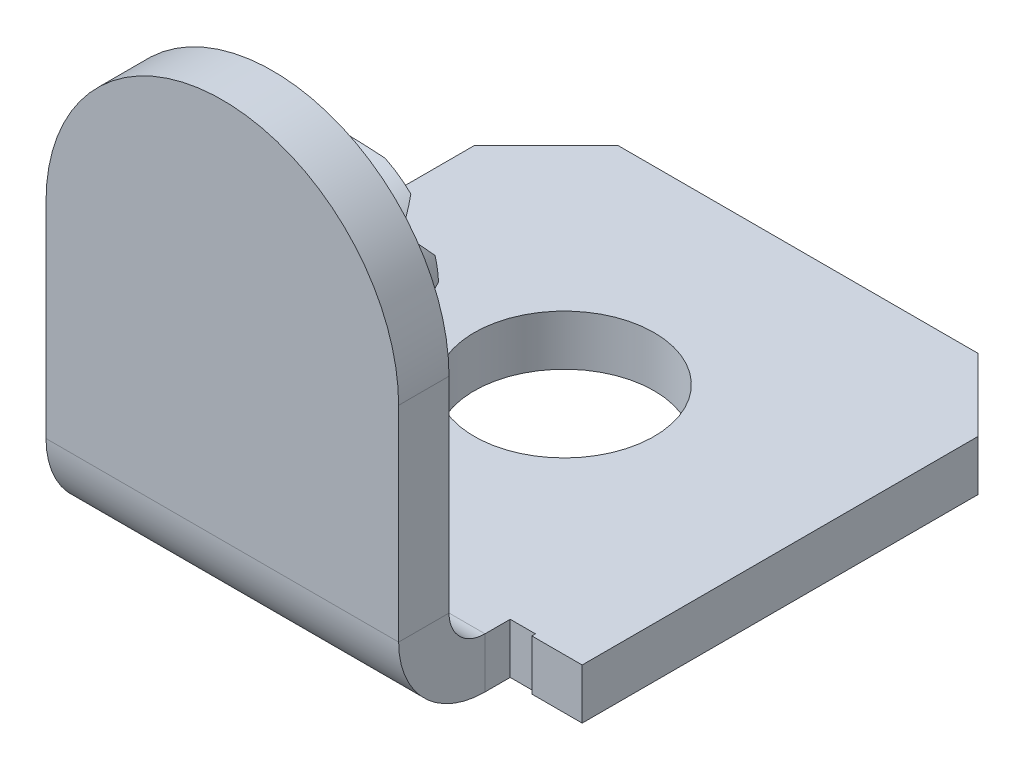
ISO-10303-21;
HEADER;
FILE_DESCRIPTION(('STEP AP214'),'2;1');
FILE_NAME('part.step','',(''),(''),'','','');
FILE_SCHEMA(('AUTOMOTIVE_DESIGN { 1 0 10303 214 1 1 1 1 }'));
ENDSEC;
DATA;
#1=APPLICATION_CONTEXT('core data for automotive mechanical design processes');
#2=APPLICATION_PROTOCOL_DEFINITION('international standard','automotive_design',2000,#1);
#3=PRODUCT_CONTEXT('',#1,'mechanical');
#4=PRODUCT('Part','Part','',(#3));
#5=PRODUCT_RELATED_PRODUCT_CATEGORY('part','',(#4));
#6=PRODUCT_DEFINITION_FORMATION('','',#4);
#7=PRODUCT_DEFINITION_CONTEXT('part definition',#1,'design');
#8=PRODUCT_DEFINITION('design','',#6,#7);
#9=PRODUCT_DEFINITION_SHAPE('','',#8);
#10=(LENGTH_UNIT() NAMED_UNIT(*) SI_UNIT(.MILLI.,.METRE.));
#11=(NAMED_UNIT(*) PLANE_ANGLE_UNIT() SI_UNIT($,.RADIAN.));
#12=(NAMED_UNIT(*) SI_UNIT($,.STERADIAN.) SOLID_ANGLE_UNIT());
#13=UNCERTAINTY_MEASURE_WITH_UNIT(LENGTH_MEASURE(1.E-05),#10,'distance_accuracy_value','');
#14=(GEOMETRIC_REPRESENTATION_CONTEXT(3) GLOBAL_UNCERTAINTY_ASSIGNED_CONTEXT((#13)) GLOBAL_UNIT_ASSIGNED_CONTEXT((#10,
#11,#12)) REPRESENTATION_CONTEXT('',''));
#15=CARTESIAN_POINT('',(0.,0.,0.));
#16=DIRECTION('',(0.,0.,1.));
#17=DIRECTION('',(1.,0.,0.));
#18=AXIS2_PLACEMENT_3D('',#15,#16,#17);
#19=CARTESIAN_POINT('',(0.,3.35,3.05));
#20=DIRECTION('',(0.,0.,-1.));
#21=DIRECTION('',(-1.,0.,0.));
#22=AXIS2_PLACEMENT_3D('',#19,#20,#21);
#23=PLANE('',#22);
#24=DIRECTION('',(1.,0.,0.));
#25=VECTOR('',#24,1.);
#26=CARTESIAN_POINT('',(0.,2.1647478800214,3.05));
#27=LINE('',#26,#25);
#28=CARTESIAN_POINT('',(-0.547822986546511,2.1647478800214,3.05));
#29=VERTEX_POINT('',#28);
#30=CARTESIAN_POINT('',(0.547822986546511,2.1647478800214,3.05));
#31=VERTEX_POINT('',#30);
#32=EDGE_CURVE('E446',#29,#31,#27,.T.);
#33=ORIENTED_EDGE('',*,*,#32,.F.);
#34=CARTESIAN_POINT('',(0.,3.35,3.05));
#35=DIRECTION('',(0.,0.,-1.));
#36=DIRECTION('',(-1.,0.,0.));
#37=AXIS2_PLACEMENT_3D('',#34,#35,#36);
#38=CIRCLE('',#37,1.30573068145866);
#39=CARTESIAN_POINT('',(-0.795916672141053,2.31489166580961,3.05));
#40=VERTEX_POINT('',#39);
#41=EDGE_CURVE('E599',#29,#40,#38,.T.);
#42=ORIENTED_EDGE('',*,*,#41,.T.);
#43=DIRECTION('',(-1.,0.,0.));
#44=VECTOR('',#43,1.);
#45=CARTESIAN_POINT('',(0.,2.31489166580961,3.05));
#46=LINE('',#45,#44);
#47=CARTESIAN_POINT('',(0.795916672141053,2.31489166580961,3.05));
#48=VERTEX_POINT('',#47);
#49=EDGE_CURVE('E444',#48,#40,#46,.T.);
#50=ORIENTED_EDGE('',*,*,#49,.F.);
#51=EDGE_CURVE('E592',#48,#31,#38,.T.);
#52=ORIENTED_EDGE('',*,*,#51,.T.);
#53=EDGE_LOOP('',(#33,#42,#50,#52));
#54=FACE_BOUND('',#53,.T.);
#55=ADVANCED_FACE('F77',(#54),#23,.T.);
#56=DIRECTION('',(1.,0.,0.));
#57=VECTOR('',#56,1.);
#58=CARTESIAN_POINT('',(0.,2.61454519184912,3.05));
#59=LINE('',#58,#57);
#60=CARTESIAN_POINT('',(-1.07890631552061,2.61454519184912,3.05));
#61=VERTEX_POINT('',#60);
#62=CARTESIAN_POINT('',(1.07890631552061,2.61454519184912,3.05));
#63=VERTEX_POINT('',#62);
#64=EDGE_CURVE('E442',#61,#63,#59,.T.);
#65=ORIENTED_EDGE('',*,*,#64,.F.);
#66=CARTESIAN_POINT('',(-1.18747366065813,2.80700928392313,3.05));
#67=VERTEX_POINT('',#66);
#68=EDGE_CURVE('E299',#61,#67,#38,.T.);
#69=ORIENTED_EDGE('',*,*,#68,.T.);
#70=DIRECTION('',(-1.,0.,0.));
#71=VECTOR('',#70,1.);
#72=CARTESIAN_POINT('',(0.,2.80700928392313,3.05));
#73=LINE('',#72,#71);
#74=CARTESIAN_POINT('',(1.18747366065813,2.80700928392313,3.05));
#75=VERTEX_POINT('',#74);
#76=EDGE_CURVE('E440',#75,#67,#73,.T.);
#77=ORIENTED_EDGE('',*,*,#76,.F.);
#78=EDGE_CURVE('E600',#75,#63,#38,.T.);
#79=ORIENTED_EDGE('',*,*,#78,.T.);
#80=EDGE_LOOP('',(#65,#69,#77,#79));
#81=FACE_BOUND('',#80,.T.);
#82=ADVANCED_FACE('F524',(#81),#23,.T.);
#83=DIRECTION('',(1.,0.,0.));
#84=VECTOR('',#83,1.);
#85=CARTESIAN_POINT('',(0.,3.41081231897144,3.05));
#86=LINE('',#85,#84);
#87=CARTESIAN_POINT('',(-1.30431379443898,3.41081231897144,3.05));
#88=VERTEX_POINT('',#87);
#89=CARTESIAN_POINT('',(1.30431379443898,3.41081231897144,3.05));
#90=VERTEX_POINT('',#89);
#91=EDGE_CURVE('E438',#88,#90,#86,.T.);
#92=ORIENTED_EDGE('',*,*,#91,.F.);
#93=CARTESIAN_POINT('',(-1.25625795015122,3.70601766133768,3.05));
#94=VERTEX_POINT('',#93);
#95=EDGE_CURVE('E295',#88,#94,#38,.T.);
#96=ORIENTED_EDGE('',*,*,#95,.T.);
#97=DIRECTION('',(-1.,0.,0.));
#98=VECTOR('',#97,1.);
#99=CARTESIAN_POINT('',(0.,3.70601766133768,3.05));
#100=LINE('',#99,#98);
#101=CARTESIAN_POINT('',(1.25625795015122,3.70601766133768,3.05));
#102=VERTEX_POINT('',#101);
#103=EDGE_CURVE('E436',#102,#94,#100,.T.);
#104=ORIENTED_EDGE('',*,*,#103,.F.);
#105=EDGE_CURVE('E300',#102,#90,#38,.T.);
#106=ORIENTED_EDGE('',*,*,#105,.T.);
#107=EDGE_LOOP('',(#92,#96,#104,#106));
#108=FACE_BOUND('',#107,.T.);
#109=ADVANCED_FACE('F530',(#108),#23,.T.);
#110=CARTESIAN_POINT('',(0.,0.,4.75));
#111=DIRECTION('',(0.,0.,-1.));
#112=DIRECTION('',(-1.,0.,0.));
#113=AXIS2_PLACEMENT_3D('',#110,#111,#112);
#114=PLANE('',#113);
#115=DIRECTION('',(0.,1.,0.));
#116=VECTOR('',#115,1.);
#117=CARTESIAN_POINT('',(2.45,0.,4.75));
#118=LINE('',#117,#116);
#119=CARTESIAN_POINT('',(2.45,0.499999999999998,4.75));
#120=VERTEX_POINT('',#119);
#121=CARTESIAN_POINT('',(2.45,3.35,4.75));
#122=VERTEX_POINT('',#121);
#123=EDGE_CURVE('E312',#120,#122,#118,.T.);
#124=ORIENTED_EDGE('',*,*,#123,.T.);
#125=CARTESIAN_POINT('',(0.,3.35,4.75));
#126=DIRECTION('',(0.,0.,-1.));
#127=DIRECTION('',(-1.,0.,0.));
#128=AXIS2_PLACEMENT_3D('',#125,#126,#127);
#129=CIRCLE('',#128,2.45);
#130=CARTESIAN_POINT('',(-2.45,3.35,4.75));
#131=VERTEX_POINT('',#130);
#132=EDGE_CURVE('E309',#131,#122,#129,.T.);
#133=ORIENTED_EDGE('',*,*,#132,.F.);
#134=DIRECTION('',(0.,-1.,0.));
#135=VECTOR('',#134,1.);
#136=CARTESIAN_POINT('',(-2.45,0.,4.75));
#137=LINE('',#136,#135);
#138=CARTESIAN_POINT('',(-2.45,0.499999999999998,4.75));
#139=VERTEX_POINT('',#138);
#140=EDGE_CURVE('E316',#131,#139,#137,.T.);
#141=ORIENTED_EDGE('',*,*,#140,.T.);
#142=DIRECTION('',(1.,0.,0.));
#143=VECTOR('',#142,1.);
#144=CARTESIAN_POINT('',(-2.45,0.499999999999998,4.75));
#145=LINE('',#144,#143);
#146=EDGE_CURVE('E323',#120,#139,#145,.F.);
#147=ORIENTED_EDGE('',*,*,#146,.F.);
#148=EDGE_LOOP('',(#124,#133,#141,#147));
#149=FACE_BOUND('',#148,.T.);
#150=ADVANCED_FACE('F543',(#149),#114,.F.);
#151=CARTESIAN_POINT('',(0.,0.,4.05));
#152=DIRECTION('',(0.,0.,-1.));
#153=DIRECTION('',(-1.,0.,0.));
#154=AXIS2_PLACEMENT_3D('',#151,#152,#153);
#155=PLANE('',#154);
#156=CARTESIAN_POINT('',(0.,3.35,4.05));
#157=DIRECTION('',(0.,0.,-1.));
#158=DIRECTION('',(-1.,0.,0.));
#159=AXIS2_PLACEMENT_3D('',#156,#157,#158);
#160=CIRCLE('',#159,1.);
#161=CARTESIAN_POINT('',(-1.,3.35,4.05));
#162=VERTEX_POINT('',#161);
#163=EDGE_CURVE('E303',#162,#162,#160,.T.);
#164=ORIENTED_EDGE('',*,*,#163,.F.);
#165=EDGE_LOOP('',(#164));
#166=FACE_BOUND('',#165,.T.);
#167=CARTESIAN_POINT('',(0.,3.35,4.05));
#168=DIRECTION('',(0.,0.,-1.));
#169=DIRECTION('',(-1.,0.,0.));
#170=AXIS2_PLACEMENT_3D('',#167,#168,#169);
#171=CIRCLE('',#170,2.45);
#172=CARTESIAN_POINT('',(-2.45,3.35,4.05));
#173=VERTEX_POINT('',#172);
#174=CARTESIAN_POINT('',(2.45,3.35,4.05));
#175=VERTEX_POINT('',#174);
#176=EDGE_CURVE('E298',#173,#175,#171,.T.);
#177=ORIENTED_EDGE('',*,*,#176,.T.);
#178=DIRECTION('',(0.,-1.,0.));
#179=VECTOR('',#178,1.);
#180=CARTESIAN_POINT('',(2.45,5.8,4.05));
#181=LINE('',#180,#179);
#182=CARTESIAN_POINT('',(2.45,0.499999999999998,4.05));
#183=VERTEX_POINT('',#182);
#184=EDGE_CURVE('E318',#183,#175,#181,.F.);
#185=ORIENTED_EDGE('',*,*,#184,.F.);
#186=DIRECTION('',(1.,0.,0.));
#187=VECTOR('',#186,1.);
#188=CARTESIAN_POINT('',(-2.45,0.499999999999998,4.05));
#189=LINE('',#188,#187);
#190=CARTESIAN_POINT('',(-2.45,0.499999999999998,4.05));
#191=VERTEX_POINT('',#190);
#192=EDGE_CURVE('E329',#191,#183,#189,.T.);
#193=ORIENTED_EDGE('',*,*,#192,.F.);
#194=DIRECTION('',(0.,1.,0.));
#195=VECTOR('',#194,1.);
#196=CARTESIAN_POINT('',(-2.45,0.,4.05));
#197=LINE('',#196,#195);
#198=EDGE_CURVE('E321',#173,#191,#197,.F.);
#199=ORIENTED_EDGE('',*,*,#198,.F.);
#200=EDGE_LOOP('',(#177,#185,#193,#199));
#201=FACE_BOUND('',#200,.T.);
#202=ADVANCED_FACE('F548',(#166,#201),#155,.T.);
#203=CARTESIAN_POINT('',(2.45,5.8,4.75));
#204=DIRECTION('',(-1.,0.,0.));
#205=DIRECTION('',(0.,0.,1.));
#206=AXIS2_PLACEMENT_3D('',#203,#204,#205);
#207=PLANE('',#206);
#208=DIRECTION('',(0.,0.,-1.));
#209=VECTOR('',#208,1.);
#210=CARTESIAN_POINT('',(2.45,3.35,14.05));
#211=LINE('',#210,#209);
#212=EDGE_CURVE('E279',#122,#175,#211,.T.);
#213=ORIENTED_EDGE('',*,*,#212,.F.);
#214=ORIENTED_EDGE('',*,*,#123,.F.);
#215=DIRECTION('',(0.,0.,-1.));
#216=VECTOR('',#215,1.);
#217=CARTESIAN_POINT('',(2.45,0.499999999999998,4.05));
#218=LINE('',#217,#216);
#219=EDGE_CURVE('E326',#183,#120,#218,.F.);
#220=ORIENTED_EDGE('',*,*,#219,.F.);
#221=ORIENTED_EDGE('',*,*,#184,.T.);
#222=EDGE_LOOP('',(#213,#214,#220,#221));
#223=FACE_BOUND('',#222,.T.);
#224=ADVANCED_FACE('F857',(#223),#207,.F.);
#225=CARTESIAN_POINT('',(-2.8,0.,3.2));
#226=DIRECTION('',(1.,0.,0.));
#227=DIRECTION('',(0.,0.,-1.));
#228=AXIS2_PLACEMENT_3D('',#225,#226,#227);
#229=PLANE('',#228);
#230=DIRECTION('',(0.,1.,0.));
#231=VECTOR('',#230,1.);
#232=CARTESIAN_POINT('',(-2.8,-0.7,3.25));
#233=LINE('',#232,#231);
#234=CARTESIAN_POINT('',(-2.8,-0.7,3.25));
#235=VERTEX_POINT('',#234);
#236=CARTESIAN_POINT('',(-2.8,0.,3.25));
#237=VERTEX_POINT('',#236);
#238=EDGE_CURVE('E378',#235,#237,#233,.T.);
#239=ORIENTED_EDGE('',*,*,#238,.F.);
#240=DIRECTION('',(0.,0.,1.));
#241=VECTOR('',#240,1.);
#242=CARTESIAN_POINT('',(-2.8,-0.7,0.));
#243=LINE('',#242,#241);
#244=CARTESIAN_POINT('',(-2.8,-0.7,3.2));
#245=VERTEX_POINT('',#244);
#246=EDGE_CURVE('E359',#245,#235,#243,.T.);
#247=ORIENTED_EDGE('',*,*,#246,.F.);
#248=DIRECTION('',(0.,-1.,0.));
#249=VECTOR('',#248,1.);
#250=CARTESIAN_POINT('',(-2.8,0.,3.2));
#251=LINE('',#250,#249);
#252=CARTESIAN_POINT('',(-2.8,0.,3.2));
#253=VERTEX_POINT('',#252);
#254=EDGE_CURVE('E353',#253,#245,#251,.T.);
#255=ORIENTED_EDGE('',*,*,#254,.F.);
#256=DIRECTION('',(0.,0.,1.));
#257=VECTOR('',#256,1.);
#258=CARTESIAN_POINT('',(-2.8,0.,3.2));
#259=LINE('',#258,#257);
#260=EDGE_CURVE('E366',#253,#237,#259,.T.);
#261=ORIENTED_EDGE('',*,*,#260,.T.);
#262=EDGE_LOOP('',(#239,#247,#255,#261));
#263=FACE_BOUND('',#262,.T.);
#264=ADVANCED_FACE('F481',(#263),#229,.T.);
#265=CARTESIAN_POINT('',(-2.45,0.,3.2));
#266=DIRECTION('',(0.,0.,1.));
#267=DIRECTION('',(0.,-1.,0.));
#268=AXIS2_PLACEMENT_3D('',#265,#266,#267);
#269=PLANE('',#268);
#270=DIRECTION('',(-1.,0.,0.));
#271=VECTOR('',#270,1.);
#272=CARTESIAN_POINT('',(0.,-0.7,3.2));
#273=LINE('',#272,#271);
#274=CARTESIAN_POINT('',(-2.45,-0.7,3.2));
#275=VERTEX_POINT('',#274);
#276=EDGE_CURVE('E381',#275,#245,#273,.T.);
#277=ORIENTED_EDGE('',*,*,#276,.F.);
#278=DIRECTION('',(0.,-1.,0.));
#279=VECTOR('',#278,1.);
#280=CARTESIAN_POINT('',(-2.45,0.,3.2));
#281=LINE('',#280,#279);
#282=CARTESIAN_POINT('',(-2.45,0.,3.2));
#283=VERTEX_POINT('',#282);
#284=EDGE_CURVE('E365',#283,#275,#281,.T.);
#285=ORIENTED_EDGE('',*,*,#284,.F.);
#286=DIRECTION('',(-1.,0.,0.));
#287=VECTOR('',#286,1.);
#288=CARTESIAN_POINT('',(-2.45,0.,3.2));
#289=LINE('',#288,#287);
#290=EDGE_CURVE('E361',#283,#253,#289,.T.);
#291=ORIENTED_EDGE('',*,*,#290,.T.);
#292=ORIENTED_EDGE('',*,*,#254,.T.);
#293=EDGE_LOOP('',(#277,#285,#291,#292));
#294=FACE_BOUND('',#293,.T.);
#295=ADVANCED_FACE('F484',(#294),#269,.T.);
#296=CARTESIAN_POINT('',(3.5,-0.7,3.25));
#297=DIRECTION('',(0.,0.,1.));
#298=DIRECTION('',(1.,0.,0.));
#299=AXIS2_PLACEMENT_3D('',#296,#297,#298);
#300=PLANE('',#299);
#301=DIRECTION('',(1.,0.,0.));
#302=VECTOR('',#301,1.);
#303=CARTESIAN_POINT('',(3.5,0.,3.25));
#304=LINE('',#303,#302);
#305=CARTESIAN_POINT('',(2.8,0.,3.25));
#306=VERTEX_POINT('',#305);
#307=CARTESIAN_POINT('',(3.5,0.,3.25));
#308=VERTEX_POINT('',#307);
#309=EDGE_CURVE('E418',#306,#308,#304,.T.);
#310=ORIENTED_EDGE('',*,*,#309,.F.);
#311=DIRECTION('',(0.,-1.,0.));
#312=VECTOR('',#311,1.);
#313=CARTESIAN_POINT('',(2.8,-0.7,3.25));
#314=LINE('',#313,#312);
#315=CARTESIAN_POINT('',(2.8,-0.7,3.25));
#316=VERTEX_POINT('',#315);
#317=EDGE_CURVE('E388',#306,#316,#314,.T.);
#318=ORIENTED_EDGE('',*,*,#317,.T.);
#319=DIRECTION('',(1.,0.,0.));
#320=VECTOR('',#319,1.);
#321=CARTESIAN_POINT('',(3.5,-0.7,3.25));
#322=LINE('',#321,#320);
#323=CARTESIAN_POINT('',(3.5,-0.7,3.25));
#324=VERTEX_POINT('',#323);
#325=EDGE_CURVE('E402',#316,#324,#322,.T.);
#326=ORIENTED_EDGE('',*,*,#325,.T.);
#327=DIRECTION('',(0.,1.,0.));
#328=VECTOR('',#327,1.);
#329=CARTESIAN_POINT('',(3.5,-0.7,3.25));
#330=LINE('',#329,#328);
#331=EDGE_CURVE('E425',#324,#308,#330,.T.);
#332=ORIENTED_EDGE('',*,*,#331,.T.);
#333=EDGE_LOOP('',(#310,#318,#326,#332));
#334=FACE_BOUND('',#333,.T.);
#335=ADVANCED_FACE('F507',(#334),#300,.T.);
#336=CARTESIAN_POINT('',(2.45,-0.7,3.25));
#337=DIRECTION('',(1.,0.,0.));
#338=DIRECTION('',(0.,0.,-1.));
#339=AXIS2_PLACEMENT_3D('',#336,#337,#338);
#340=PLANE('',#339);
#341=DIRECTION('',(0.,0.,-1.));
#342=VECTOR('',#341,1.);
#343=CARTESIAN_POINT('',(2.45,0.,3.25));
#344=LINE('',#343,#342);
#345=CARTESIAN_POINT('',(2.45,0.,3.55));
#346=VERTEX_POINT('',#345);
#347=CARTESIAN_POINT('',(2.45,0.,3.2));
#348=VERTEX_POINT('',#347);
#349=EDGE_CURVE('E416',#346,#348,#344,.T.);
#350=ORIENTED_EDGE('',*,*,#349,.F.);
#351=DIRECTION('',(0.,-1.,0.));
#352=VECTOR('',#351,1.);
#353=CARTESIAN_POINT('',(2.45,0.,3.55));
#354=LINE('',#353,#352);
#355=CARTESIAN_POINT('',(2.45,-0.700000000000002,3.55));
#356=VERTEX_POINT('',#355);
#357=EDGE_CURVE('E340',#346,#356,#354,.T.);
#358=ORIENTED_EDGE('',*,*,#357,.T.);
#359=DIRECTION('',(0.,0.,-1.));
#360=VECTOR('',#359,1.);
#361=CARTESIAN_POINT('',(2.45,-0.7,3.25));
#362=LINE('',#361,#360);
#363=CARTESIAN_POINT('',(2.45,-0.7,3.2));
#364=VERTEX_POINT('',#363);
#365=EDGE_CURVE('E400',#356,#364,#362,.T.);
#366=ORIENTED_EDGE('',*,*,#365,.T.);
#367=DIRECTION('',(0.,-1.,0.));
#368=VECTOR('',#367,1.);
#369=CARTESIAN_POINT('',(2.45,0.,3.2));
#370=LINE('',#369,#368);
#371=EDGE_CURVE('E364',#348,#364,#370,.T.);
#372=ORIENTED_EDGE('',*,*,#371,.F.);
#373=EDGE_LOOP('',(#350,#358,#366,#372));
#374=FACE_BOUND('',#373,.T.);
#375=ADVANCED_FACE('F494',(#374),#340,.T.);
#376=CARTESIAN_POINT('',(-2.45,-0.7,3.25));
#377=DIRECTION('',(0.,0.,1.));
#378=DIRECTION('',(1.,0.,0.));
#379=AXIS2_PLACEMENT_3D('',#376,#377,#378);
#380=PLANE('',#379);
#381=DIRECTION('',(1.,0.,0.));
#382=VECTOR('',#381,1.);
#383=CARTESIAN_POINT('',(-2.45,-0.7,3.25));
#384=LINE('',#383,#382);
#385=CARTESIAN_POINT('',(-3.5,-0.7,3.25));
#386=VERTEX_POINT('',#385);
#387=EDGE_CURVE('E393',#386,#235,#384,.T.);
#388=ORIENTED_EDGE('',*,*,#387,.T.);
#389=ORIENTED_EDGE('',*,*,#238,.T.);
#390=DIRECTION('',(1.,0.,0.));
#391=VECTOR('',#390,1.);
#392=CARTESIAN_POINT('',(-2.45,0.,3.25));
#393=LINE('',#392,#391);
#394=CARTESIAN_POINT('',(-3.5,0.,3.25));
#395=VERTEX_POINT('',#394);
#396=EDGE_CURVE('E411',#395,#237,#393,.T.);
#397=ORIENTED_EDGE('',*,*,#396,.F.);
#398=DIRECTION('',(0.,1.,0.));
#399=VECTOR('',#398,1.);
#400=CARTESIAN_POINT('',(-3.5,-0.7,3.25));
#401=LINE('',#400,#399);
#402=EDGE_CURVE('E409',#386,#395,#401,.T.);
#403=ORIENTED_EDGE('',*,*,#402,.F.);
#404=EDGE_LOOP('',(#388,#389,#397,#403));
#405=FACE_BOUND('',#404,.T.);
#406=ADVANCED_FACE('F474',(#405),#380,.T.);
#407=CARTESIAN_POINT('',(0.,-0.7,0.));
#408=DIRECTION('',(0.,-1.,0.));
#409=DIRECTION('',(0.,0.,-1.));
#410=AXIS2_PLACEMENT_3D('',#407,#408,#409);
#411=PLANE('',#410);
#412=CARTESIAN_POINT('',(0.,-0.7,0.));
#413=DIRECTION('',(0.,-1.,0.));
#414=DIRECTION('',(0.,0.,-1.));
#415=AXIS2_PLACEMENT_3D('',#412,#413,#414);
#416=CIRCLE('',#415,1.25);
#417=CARTESIAN_POINT('',(0.,-0.7,-1.25));
#418=VERTEX_POINT('',#417);
#419=EDGE_CURVE('E621',#418,#418,#416,.T.);
#420=ORIENTED_EDGE('',*,*,#419,.F.);
#421=EDGE_LOOP('',(#420));
#422=FACE_BOUND('',#421,.T.);
#423=DIRECTION('',(0.,0.,1.));
#424=VECTOR('',#423,1.);
#425=CARTESIAN_POINT('',(-3.5,-0.7,-3.25));
#426=LINE('',#425,#424);
#427=CARTESIAN_POINT('',(-3.5,-0.7,-2.25));
#428=VERTEX_POINT('',#427);
#429=EDGE_CURVE('E391',#428,#386,#426,.T.);
#430=ORIENTED_EDGE('',*,*,#429,.F.);
#431=DIRECTION('',(-0.707106781186547,0.,0.707106781186548));
#432=VECTOR('',#431,1.);
#433=CARTESIAN_POINT('',(-2.875,-0.7,-2.875));
#434=LINE('',#433,#432);
#435=CARTESIAN_POINT('',(-2.5,-0.7,-3.25));
#436=VERTEX_POINT('',#435);
#437=EDGE_CURVE('E85',#428,#436,#434,.F.);
#438=ORIENTED_EDGE('',*,*,#437,.T.);
#439=DIRECTION('',(-1.,0.,0.));
#440=VECTOR('',#439,1.);
#441=CARTESIAN_POINT('',(3.5,-0.7,-3.25));
#442=LINE('',#441,#440);
#443=CARTESIAN_POINT('',(2.5,-0.7,-3.25));
#444=VERTEX_POINT('',#443);
#445=EDGE_CURVE('E406',#444,#436,#442,.T.);
#446=ORIENTED_EDGE('',*,*,#445,.F.);
#447=DIRECTION('',(-0.707106781186548,0.,-0.707106781186547));
#448=VECTOR('',#447,1.);
#449=CARTESIAN_POINT('',(2.875,-0.7,-2.875));
#450=LINE('',#449,#448);
#451=CARTESIAN_POINT('',(3.5,-0.7,-2.25));
#452=VERTEX_POINT('',#451);
#453=EDGE_CURVE('E92',#444,#452,#450,.F.);
#454=ORIENTED_EDGE('',*,*,#453,.T.);
#455=DIRECTION('',(0.,0.,-1.));
#456=VECTOR('',#455,1.);
#457=CARTESIAN_POINT('',(3.5,-0.7,-3.25));
#458=LINE('',#457,#456);
#459=EDGE_CURVE('E404',#324,#452,#458,.T.);
#460=ORIENTED_EDGE('',*,*,#459,.F.);
#461=ORIENTED_EDGE('',*,*,#325,.F.);
#462=DIRECTION('',(0.,0.,-1.));
#463=VECTOR('',#462,1.);
#464=CARTESIAN_POINT('',(2.8,-0.7,0.));
#465=LINE('',#464,#463);
#466=CARTESIAN_POINT('',(2.8,-0.7,3.2));
#467=VERTEX_POINT('',#466);
#468=EDGE_CURVE('E386',#316,#467,#465,.T.);
#469=ORIENTED_EDGE('',*,*,#468,.T.);
#470=DIRECTION('',(-1.,0.,0.));
#471=VECTOR('',#470,1.);
#472=CARTESIAN_POINT('',(0.,-0.7,3.2));
#473=LINE('',#472,#471);
#474=EDGE_CURVE('E383',#467,#364,#473,.T.);
#475=ORIENTED_EDGE('',*,*,#474,.T.);
#476=ORIENTED_EDGE('',*,*,#365,.F.);
#477=DIRECTION('',(1.,0.,0.));
#478=VECTOR('',#477,1.);
#479=CARTESIAN_POINT('',(2.45,-0.700000000000002,3.55));
#480=LINE('',#479,#478);
#481=CARTESIAN_POINT('',(-2.45,-0.7,3.55));
#482=VERTEX_POINT('',#481);
#483=EDGE_CURVE('E333',#356,#482,#480,.F.);
#484=ORIENTED_EDGE('',*,*,#483,.T.);
#485=DIRECTION('',(0.,0.,1.));
#486=VECTOR('',#485,1.);
#487=CARTESIAN_POINT('',(-2.45,-0.7,3.25));
#488=LINE('',#487,#486);
#489=EDGE_CURVE('E397',#275,#482,#488,.T.);
#490=ORIENTED_EDGE('',*,*,#489,.F.);
#491=ORIENTED_EDGE('',*,*,#276,.T.);
#492=ORIENTED_EDGE('',*,*,#246,.T.);
#493=ORIENTED_EDGE('',*,*,#387,.F.);
#494=EDGE_LOOP('',(#430,#438,#446,#454,#460,#461,#469,#475,#476,#484,#490,#491,#492,#493));
#495=FACE_BOUND('',#494,.T.);
#496=ADVANCED_FACE('F459',(#422,#495),#411,.T.);
#497=CARTESIAN_POINT('',(0.,0.,0.));
#498=DIRECTION('',(0.,-1.,0.));
#499=DIRECTION('',(0.,0.,-1.));
#500=AXIS2_PLACEMENT_3D('',#497,#498,#499);
#501=PLANE('',#500);
#502=CARTESIAN_POINT('',(0.,0.,0.));
#503=DIRECTION('',(0.,-1.,0.));
#504=DIRECTION('',(0.,0.,-1.));
#505=AXIS2_PLACEMENT_3D('',#502,#503,#504);
#506=CIRCLE('',#505,1.25);
#507=CARTESIAN_POINT('',(0.,0.,-1.25));
#508=VERTEX_POINT('',#507);
#509=EDGE_CURVE('E616',#508,#508,#506,.T.);
#510=ORIENTED_EDGE('',*,*,#509,.T.);
#511=EDGE_LOOP('',(#510));
#512=FACE_BOUND('',#511,.T.);
#513=DIRECTION('',(-1.,0.,0.));
#514=VECTOR('',#513,1.);
#515=CARTESIAN_POINT('',(3.5,0.,-3.25));
#516=LINE('',#515,#514);
#517=CARTESIAN_POINT('',(2.5,0.,-3.25));
#518=VERTEX_POINT('',#517);
#519=CARTESIAN_POINT('',(-2.5,0.,-3.25));
#520=VERTEX_POINT('',#519);
#521=EDGE_CURVE('E394',#518,#520,#516,.T.);
#522=ORIENTED_EDGE('',*,*,#521,.T.);
#523=DIRECTION('',(0.707106781186547,0.,-0.707106781186548));
#524=VECTOR('',#523,1.);
#525=CARTESIAN_POINT('',(-2.5,0.,-3.25));
#526=LINE('',#525,#524);
#527=CARTESIAN_POINT('',(-3.5,0.,-2.25));
#528=VERTEX_POINT('',#527);
#529=EDGE_CURVE('E455',#520,#528,#526,.F.);
#530=ORIENTED_EDGE('',*,*,#529,.T.);
#531=DIRECTION('',(0.,0.,1.));
#532=VECTOR('',#531,1.);
#533=CARTESIAN_POINT('',(-3.5,0.,-3.25));
#534=LINE('',#533,#532);
#535=EDGE_CURVE('E390',#528,#395,#534,.T.);
#536=ORIENTED_EDGE('',*,*,#535,.T.);
#537=ORIENTED_EDGE('',*,*,#396,.T.);
#538=ORIENTED_EDGE('',*,*,#260,.F.);
#539=ORIENTED_EDGE('',*,*,#290,.F.);
#540=DIRECTION('',(0.,0.,1.));
#541=VECTOR('',#540,1.);
#542=CARTESIAN_POINT('',(-2.45,0.,3.25));
#543=LINE('',#542,#541);
#544=CARTESIAN_POINT('',(-2.45,0.,3.55));
#545=VERTEX_POINT('',#544);
#546=EDGE_CURVE('E413',#283,#545,#543,.T.);
#547=ORIENTED_EDGE('',*,*,#546,.T.);
#548=DIRECTION('',(1.,0.,0.));
#549=VECTOR('',#548,1.);
#550=CARTESIAN_POINT('',(2.45,0.,3.55));
#551=LINE('',#550,#549);
#552=EDGE_CURVE('E346',#346,#545,#551,.F.);
#553=ORIENTED_EDGE('',*,*,#552,.F.);
#554=ORIENTED_EDGE('',*,*,#349,.T.);
#555=DIRECTION('',(-1.,0.,0.));
#556=VECTOR('',#555,1.);
#557=CARTESIAN_POINT('',(2.8,0.,3.2));
#558=LINE('',#557,#556);
#559=CARTESIAN_POINT('',(2.8,0.,3.2));
#560=VERTEX_POINT('',#559);
#561=EDGE_CURVE('E356',#560,#348,#558,.T.);
#562=ORIENTED_EDGE('',*,*,#561,.F.);
#563=DIRECTION('',(0.,0.,-1.));
#564=VECTOR('',#563,1.);
#565=CARTESIAN_POINT('',(2.8,0.,0.));
#566=LINE('',#565,#564);
#567=EDGE_CURVE('E428',#306,#560,#566,.T.);
#568=ORIENTED_EDGE('',*,*,#567,.F.);
#569=ORIENTED_EDGE('',*,*,#309,.T.);
#570=DIRECTION('',(0.,0.,-1.));
#571=VECTOR('',#570,1.);
#572=CARTESIAN_POINT('',(3.5,0.,-3.25));
#573=LINE('',#572,#571);
#574=CARTESIAN_POINT('',(3.5,0.,-2.25));
#575=VERTEX_POINT('',#574);
#576=EDGE_CURVE('E420',#308,#575,#573,.T.);
#577=ORIENTED_EDGE('',*,*,#576,.T.);
#578=DIRECTION('',(0.707106781186548,0.,0.707106781186547));
#579=VECTOR('',#578,1.);
#580=CARTESIAN_POINT('',(3.5,0.,-2.25));
#581=LINE('',#580,#579);
#582=EDGE_CURVE('E453',#575,#518,#581,.F.);
#583=ORIENTED_EDGE('',*,*,#582,.T.);
#584=EDGE_LOOP('',(#522,#530,#536,#537,#538,#539,#547,#553,#554,#562,#568,#569,#577,#583));
#585=FACE_BOUND('',#584,.T.);
#586=ADVANCED_FACE('F469',(#512,#585),#501,.F.);
#587=CARTESIAN_POINT('',(-3.5,-0.7,-3.25));
#588=DIRECTION('',(-1.,0.,0.));
#589=DIRECTION('',(0.,0.,1.));
#590=AXIS2_PLACEMENT_3D('',#587,#588,#589);
#591=PLANE('',#590);
#592=ORIENTED_EDGE('',*,*,#535,.F.);
#593=DIRECTION('',(0.,-1.,0.));
#594=VECTOR('',#593,1.);
#595=CARTESIAN_POINT('',(-3.5,-0.7,-2.25));
#596=LINE('',#595,#594);
#597=EDGE_CURVE('E100',#528,#428,#596,.T.);
#598=ORIENTED_EDGE('',*,*,#597,.T.);
#599=ORIENTED_EDGE('',*,*,#429,.T.);
#600=ORIENTED_EDGE('',*,*,#402,.T.);
#601=EDGE_LOOP('',(#592,#598,#599,#600));
#602=FACE_BOUND('',#601,.T.);
#603=ADVANCED_FACE('F470',(#602),#591,.T.);
#604=CARTESIAN_POINT('',(3.5,-0.7,-3.25));
#605=DIRECTION('',(0.,0.,-1.));
#606=DIRECTION('',(-1.,0.,0.));
#607=AXIS2_PLACEMENT_3D('',#604,#605,#606);
#608=PLANE('',#607);
#609=ORIENTED_EDGE('',*,*,#445,.T.);
#610=DIRECTION('',(0.,1.,0.));
#611=VECTOR('',#610,1.);
#612=CARTESIAN_POINT('',(-2.5,-0.7,-3.25));
#613=LINE('',#612,#611);
#614=EDGE_CURVE('E450',#436,#520,#613,.T.);
#615=ORIENTED_EDGE('',*,*,#614,.T.);
#616=ORIENTED_EDGE('',*,*,#521,.F.);
#617=DIRECTION('',(0.,-1.,0.));
#618=VECTOR('',#617,1.);
#619=CARTESIAN_POINT('',(2.5,-0.7,-3.25));
#620=LINE('',#619,#618);
#621=EDGE_CURVE('E448',#518,#444,#620,.T.);
#622=ORIENTED_EDGE('',*,*,#621,.T.);
#623=EDGE_LOOP('',(#609,#615,#616,#622));
#624=FACE_BOUND('',#623,.T.);
#625=ADVANCED_FACE('F464',(#624),#608,.T.);
#626=CARTESIAN_POINT('',(3.5,-0.7,-3.25));
#627=DIRECTION('',(1.,0.,0.));
#628=DIRECTION('',(0.,0.,-1.));
#629=AXIS2_PLACEMENT_3D('',#626,#627,#628);
#630=PLANE('',#629);
#631=ORIENTED_EDGE('',*,*,#459,.T.);
#632=DIRECTION('',(0.,1.,0.));
#633=VECTOR('',#632,1.);
#634=CARTESIAN_POINT('',(3.5,-0.7,-2.25));
#635=LINE('',#634,#633);
#636=EDGE_CURVE('E13',#452,#575,#635,.T.);
#637=ORIENTED_EDGE('',*,*,#636,.T.);
#638=ORIENTED_EDGE('',*,*,#576,.F.);
#639=ORIENTED_EDGE('',*,*,#331,.F.);
#640=EDGE_LOOP('',(#631,#637,#638,#639));
#641=FACE_BOUND('',#640,.T.);
#642=ADVANCED_FACE('F511',(#641),#630,.T.);
#643=CARTESIAN_POINT('',(-2.45,-0.7,3.25));
#644=DIRECTION('',(-1.,0.,0.));
#645=DIRECTION('',(0.,0.,1.));
#646=AXIS2_PLACEMENT_3D('',#643,#644,#645);
#647=PLANE('',#646);
#648=DIRECTION('',(0.,-1.,0.));
#649=VECTOR('',#648,1.);
#650=CARTESIAN_POINT('',(-2.45,0.,3.55));
#651=LINE('',#650,#649);
#652=EDGE_CURVE('E350',#545,#482,#651,.T.);
#653=ORIENTED_EDGE('',*,*,#652,.F.);
#654=ORIENTED_EDGE('',*,*,#546,.F.);
#655=ORIENTED_EDGE('',*,*,#284,.T.);
#656=ORIENTED_EDGE('',*,*,#489,.T.);
#657=EDGE_LOOP('',(#653,#654,#655,#656));
#658=FACE_BOUND('',#657,.T.);
#659=ADVANCED_FACE('F487',(#658),#647,.T.);
#660=CARTESIAN_POINT('',(2.8,0.,4.75));
#661=DIRECTION('',(-1.,0.,0.));
#662=DIRECTION('',(0.,0.,1.));
#663=AXIS2_PLACEMENT_3D('',#660,#661,#662);
#664=PLANE('',#663);
#665=ORIENTED_EDGE('',*,*,#317,.F.);
#666=ORIENTED_EDGE('',*,*,#567,.T.);
#667=DIRECTION('',(0.,-1.,0.));
#668=VECTOR('',#667,1.);
#669=CARTESIAN_POINT('',(2.8,0.,3.2));
#670=LINE('',#669,#668);
#671=EDGE_CURVE('E360',#560,#467,#670,.T.);
#672=ORIENTED_EDGE('',*,*,#671,.T.);
#673=ORIENTED_EDGE('',*,*,#468,.F.);
#674=EDGE_LOOP('',(#665,#666,#672,#673));
#675=FACE_BOUND('',#674,.T.);
#676=ADVANCED_FACE('F503',(#675),#664,.T.);
#677=CARTESIAN_POINT('',(2.8,0.,3.2));
#678=DIRECTION('',(0.,0.,1.));
#679=DIRECTION('',(0.,-1.,0.));
#680=AXIS2_PLACEMENT_3D('',#677,#678,#679);
#681=PLANE('',#680);
#682=ORIENTED_EDGE('',*,*,#474,.F.);
#683=ORIENTED_EDGE('',*,*,#671,.F.);
#684=ORIENTED_EDGE('',*,*,#561,.T.);
#685=ORIENTED_EDGE('',*,*,#371,.T.);
#686=EDGE_LOOP('',(#682,#683,#684,#685));
#687=FACE_BOUND('',#686,.T.);
#688=ADVANCED_FACE('F499',(#687),#681,.T.);
#689=CARTESIAN_POINT('',(-2.45,0.499999999999998,3.55));
#690=DIRECTION('',(-1.,0.,0.));
#691=DIRECTION('',(0.,0.,1.));
#692=AXIS2_PLACEMENT_3D('',#689,#690,#691);
#693=PLANE('',#692);
#694=DIRECTION('',(0.,0.,-1.));
#695=VECTOR('',#694,1.);
#696=CARTESIAN_POINT('',(-2.45,0.499999999999998,4.75));
#697=LINE('',#696,#695);
#698=EDGE_CURVE('E311',#191,#139,#697,.F.);
#699=ORIENTED_EDGE('',*,*,#698,.F.);
#700=CARTESIAN_POINT('',(-2.45,0.499999999999998,3.55));
#701=DIRECTION('',(1.,0.,0.));
#702=DIRECTION('',(0.,0.,-1.));
#703=AXIS2_PLACEMENT_3D('',#700,#701,#702);
#704=CIRCLE('',#703,0.5);
#705=EDGE_CURVE('E343',#545,#191,#704,.F.);
#706=ORIENTED_EDGE('',*,*,#705,.F.);
#707=ORIENTED_EDGE('',*,*,#652,.T.);
#708=CARTESIAN_POINT('',(-2.45,0.499999999999998,3.55));
#709=DIRECTION('',(1.,0.,0.));
#710=DIRECTION('',(0.,0.,-1.));
#711=AXIS2_PLACEMENT_3D('',#708,#709,#710);
#712=CIRCLE('',#711,1.2);
#713=EDGE_CURVE('E336',#482,#139,#712,.F.);
#714=ORIENTED_EDGE('',*,*,#713,.T.);
#715=EDGE_LOOP('',(#699,#706,#707,#714));
#716=FACE_BOUND('',#715,.T.);
#717=ADVANCED_FACE('F679',(#716),#693,.T.);
#718=CARTESIAN_POINT('',(2.45,0.499999999999998,3.55));
#719=DIRECTION('',(-1.,0.,0.));
#720=DIRECTION('',(0.,0.,1.));
#721=AXIS2_PLACEMENT_3D('',#718,#719,#720);
#722=PLANE('',#721);
#723=CARTESIAN_POINT('',(2.45,0.499999999999998,3.55));
#724=DIRECTION('',(1.,0.,0.));
#725=DIRECTION('',(0.,0.,-1.));
#726=AXIS2_PLACEMENT_3D('',#723,#724,#725);
#727=CIRCLE('',#726,0.5);
#728=EDGE_CURVE('E315',#183,#346,#727,.T.);
#729=ORIENTED_EDGE('',*,*,#728,.F.);
#730=ORIENTED_EDGE('',*,*,#219,.T.);
#731=CARTESIAN_POINT('',(2.45,0.499999999999998,3.55));
#732=DIRECTION('',(1.,0.,0.));
#733=DIRECTION('',(0.,0.,-1.));
#734=AXIS2_PLACEMENT_3D('',#731,#732,#733);
#735=CIRCLE('',#734,1.2);
#736=EDGE_CURVE('E337',#120,#356,#735,.T.);
#737=ORIENTED_EDGE('',*,*,#736,.T.);
#738=ORIENTED_EDGE('',*,*,#357,.F.);
#739=EDGE_LOOP('',(#729,#730,#737,#738));
#740=FACE_BOUND('',#739,.T.);
#741=ADVANCED_FACE('F685',(#740),#722,.F.);
#742=CARTESIAN_POINT('',(2.45,0.499999999999998,3.55));
#743=DIRECTION('',(1.,0.,0.));
#744=DIRECTION('',(0.,0.,1.));
#745=AXIS2_PLACEMENT_3D('',#742,#743,#744);
#746=CYLINDRICAL_SURFACE('',#745,1.2);
#747=ORIENTED_EDGE('',*,*,#483,.F.);
#748=ORIENTED_EDGE('',*,*,#736,.F.);
#749=ORIENTED_EDGE('',*,*,#146,.T.);
#750=ORIENTED_EDGE('',*,*,#713,.F.);
#751=EDGE_LOOP('',(#747,#748,#749,#750));
#752=FACE_BOUND('',#751,.T.);
#753=ADVANCED_FACE('F693',(#752),#746,.T.);
#754=CARTESIAN_POINT('',(2.45,0.499999999999998,3.55));
#755=DIRECTION('',(1.,0.,0.));
#756=DIRECTION('',(0.,0.,1.));
#757=AXIS2_PLACEMENT_3D('',#754,#755,#756);
#758=CYLINDRICAL_SURFACE('',#757,0.5);
#759=ORIENTED_EDGE('',*,*,#552,.T.);
#760=ORIENTED_EDGE('',*,*,#705,.T.);
#761=ORIENTED_EDGE('',*,*,#192,.T.);
#762=ORIENTED_EDGE('',*,*,#728,.T.);
#763=EDGE_LOOP('',(#759,#760,#761,#762));
#764=FACE_BOUND('',#763,.T.);
#765=ADVANCED_FACE('F701',(#764),#758,.F.);
#766=CARTESIAN_POINT('',(-2.45,0.,4.75));
#767=DIRECTION('',(1.,0.,0.));
#768=DIRECTION('',(0.,0.,-1.));
#769=AXIS2_PLACEMENT_3D('',#766,#767,#768);
#770=PLANE('',#769);
#771=ORIENTED_EDGE('',*,*,#140,.F.);
#772=DIRECTION('',(0.,0.,-1.));
#773=VECTOR('',#772,1.);
#774=CARTESIAN_POINT('',(-2.45,3.35,14.05));
#775=LINE('',#774,#773);
#776=EDGE_CURVE('E306',#131,#173,#775,.T.);
#777=ORIENTED_EDGE('',*,*,#776,.T.);
#778=ORIENTED_EDGE('',*,*,#198,.T.);
#779=ORIENTED_EDGE('',*,*,#698,.T.);
#780=EDGE_LOOP('',(#771,#777,#778,#779));
#781=FACE_BOUND('',#780,.T.);
#782=ADVANCED_FACE('F709',(#781),#770,.F.);
#783=CARTESIAN_POINT('',(0.,3.35,14.05));
#784=DIRECTION('',(0.,0.,-1.));
#785=DIRECTION('',(-1.,0.,0.));
#786=AXIS2_PLACEMENT_3D('',#783,#784,#785);
#787=CYLINDRICAL_SURFACE('',#786,2.45);
#788=ORIENTED_EDGE('',*,*,#132,.T.);
#789=ORIENTED_EDGE('',*,*,#212,.T.);
#790=ORIENTED_EDGE('',*,*,#176,.F.);
#791=ORIENTED_EDGE('',*,*,#776,.F.);
#792=EDGE_LOOP('',(#788,#789,#790,#791));
#793=FACE_BOUND('',#792,.T.);
#794=ADVANCED_FACE('F541',(#793),#787,.T.);
#795=CARTESIAN_POINT('',(0.,3.35,4.05));
#796=DIRECTION('',(0.,0.,-1.));
#797=DIRECTION('',(-1.,0.,0.));
#798=AXIS2_PLACEMENT_3D('',#795,#796,#797);
#799=CONICAL_SURFACE('',#798,1.,0.296705972839036);
#800=ORIENTED_EDGE('',*,*,#41,.F.);
#801=CARTESIAN_POINT('',(0.,3.85016117834909,1.50050712895681));
#802=DIRECTION('',(0.,0.676799260883116,0.736167617100934));
#803=DIRECTION('',(0.,0.736167617100934,-0.676799260883116));
#804=AXIS2_PLACEMENT_3D('',#801,#802,#803);
#805=ELLIPSE('',#804,2.41719161710159,1.70772077803453);
#806=EDGE_CURVE('E584',#29,#31,#805,.T.);
#807=ORIENTED_EDGE('',*,*,#806,.T.);
#808=ORIENTED_EDGE('',*,*,#51,.F.);
#809=CARTESIAN_POINT('',(0.,2.81880448276956,3.88299873823991));
#810=DIRECTION('',(0.,-0.855623194580806,0.517599216474809));
#811=DIRECTION('',(0.,-0.517599216474809,-0.855623194580806));
#812=AXIS2_PLACEMENT_3D('',#809,#810,#811);
#813=ELLIPSE('',#812,2.03063949115063,0.906947077105514);
#814=CARTESIAN_POINT('',(0.845437491491333,2.4383255599902,3.25404378425771));
#815=VERTEX_POINT('',#814);
#816=EDGE_CURVE('E583',#48,#815,#813,.T.);
#817=ORIENTED_EDGE('',*,*,#816,.T.);
#818=CARTESIAN_POINT('',(0.,3.98383107046951,1.46451108791324));
#819=DIRECTION('',(0.,0.75682300776916,0.653619870346092));
#820=DIRECTION('',(0.,0.653619870346092,-0.75682300776916));
#821=AXIS2_PLACEMENT_3D('',#818,#819,#820);
#822=ELLIPSE('',#821,2.73930363538068,1.67451991812231);
#823=EDGE_CURVE('E577',#815,#63,#822,.T.);
#824=ORIENTED_EDGE('',*,*,#823,.T.);
#825=ORIENTED_EDGE('',*,*,#78,.F.);
#826=CARTESIAN_POINT('',(0.,3.05811964192283,3.24225636784352));
#827=DIRECTION('',(0.,-0.607910502716911,0.79400555456903));
#828=DIRECTION('',(0.,-0.79400555456903,-0.607910502716911));
#829=AXIS2_PLACEMENT_3D('',#826,#827,#828);
#830=ELLIPSE('',#829,1.570457541421,1.21230985088912);
#831=CARTESIAN_POINT('',(1.21221744370193,3.07351545111687,3.25404378425771));
#832=VERTEX_POINT('',#831);
#833=EDGE_CURVE('E576',#75,#832,#830,.T.);
#834=ORIENTED_EDGE('',*,*,#833,.T.);
#835=CARTESIAN_POINT('',(0.,3.59789173339277,2.9368285023871));
#836=DIRECTION('',(0.,0.517599216474808,0.855623194580807));
#837=DIRECTION('',(0.,0.855623194580807,-0.517599216474808));
#838=AXIS2_PLACEMENT_3D('',#835,#836,#837);
#839=ELLIPSE('',#838,1.56649643094612,1.31720766082164);
#840=EDGE_CURVE('E570',#832,#90,#839,.T.);
#841=ORIENTED_EDGE('',*,*,#840,.T.);
#842=ORIENTED_EDGE('',*,*,#105,.F.);
#843=CARTESIAN_POINT('',(0.,2.95271666548709,2.39942186721994));
#844=DIRECTION('',(0.,-0.653619870346092,0.75682300776916));
#845=DIRECTION('',(0.,-0.75682300776916,-0.653619870346092));
#846=AXIS2_PLACEMENT_3D('',#843,#844,#845);
#847=ELLIPSE('',#846,1.98809016360473,1.45123552294068);
#848=CARTESIAN_POINT('',(1.04133234362682,4.00070546695033,3.30450310484728));
#849=VERTEX_POINT('',#848);
#850=EDGE_CURVE('E567',#102,#849,#847,.T.);
#851=ORIENTED_EDGE('',*,*,#850,.T.);
#852=CARTESIAN_POINT('',(0.,3.66892635584865,3.6095258360214));
#853=DIRECTION('',(0.,0.676799260883116,0.736167617100934));
#854=DIRECTION('',(0.,0.736167617100934,-0.676799260883116));
#855=AXIS2_PLACEMENT_3D('',#852,#853,#854);
#856=ELLIPSE('',#855,1.54131537432533,1.08892330736922);
#857=CARTESIAN_POINT('',(0.919029049638763,4.27753340555614,3.05));
#858=VERTEX_POINT('',#857);
#859=EDGE_CURVE('E290',#849,#858,#856,.T.);
#860=ORIENTED_EDGE('',*,*,#859,.T.);
#861=CARTESIAN_POINT('',(0.561291529912412,4.52893359904241,3.05));
#862=VERTEX_POINT('',#861);
#863=EDGE_CURVE('E289',#862,#858,#38,.T.);
#864=ORIENTED_EDGE('',*,*,#863,.F.);
#865=CARTESIAN_POINT('',(0.,2.95830447642521,1.84748707799621));
#866=DIRECTION('',(0.,-0.607910502716911,0.79400555456903));
#867=DIRECTION('',(0.,-0.79400555456903,-0.607910502716911));
#868=AXIS2_PLACEMENT_3D('',#865,#866,#867);
#869=ELLIPSE('',#868,2.1075114234862,1.62688693719275);
#870=CARTESIAN_POINT('',(-0.561291529912412,4.52893359904241,3.05));
#871=VERTEX_POINT('',#870);
#872=EDGE_CURVE('E273',#862,#871,#869,.T.);
#873=ORIENTED_EDGE('',*,*,#872,.T.);
#874=CARTESIAN_POINT('',(-0.919029049638763,4.27753340555614,3.05));
#875=VERTEX_POINT('',#874);
#876=EDGE_CURVE('E287',#875,#871,#38,.T.);
#877=ORIENTED_EDGE('',*,*,#876,.F.);
#878=CARTESIAN_POINT('',(-1.04133234362682,4.00070546695033,3.30450310484728));
#879=VERTEX_POINT('',#878);
#880=EDGE_CURVE('E563',#875,#879,#856,.T.);
#881=ORIENTED_EDGE('',*,*,#880,.T.);
#882=EDGE_CURVE('E562',#879,#94,#847,.T.);
#883=ORIENTED_EDGE('',*,*,#882,.T.);
#884=ORIENTED_EDGE('',*,*,#95,.F.);
#885=CARTESIAN_POINT('',(-1.21221744370193,3.07351545111687,3.25404378425771));
#886=VERTEX_POINT('',#885);
#887=EDGE_CURVE('E561',#88,#886,#839,.T.);
#888=ORIENTED_EDGE('',*,*,#887,.T.);
#889=EDGE_CURVE('E574',#886,#67,#830,.T.);
#890=ORIENTED_EDGE('',*,*,#889,.T.);
#891=ORIENTED_EDGE('',*,*,#68,.F.);
#892=CARTESIAN_POINT('',(-0.845437491491337,2.4383255599902,3.25404378425771));
#893=VERTEX_POINT('',#892);
#894=EDGE_CURVE('E580',#61,#893,#822,.T.);
#895=ORIENTED_EDGE('',*,*,#894,.T.);
#896=EDGE_CURVE('E581',#893,#40,#813,.T.);
#897=ORIENTED_EDGE('',*,*,#896,.T.);
#898=EDGE_LOOP('',(#800,#807,#808,#817,#824,#825,#834,#841,#842,#851,#860,#864,#873,#877,#881,
#883,#884,#888,#890,#891,#895,#897));
#899=FACE_BOUND('',#898,.T.);
#900=ORIENTED_EDGE('',*,*,#163,.T.);
#901=EDGE_LOOP('',(#900));
#902=FACE_BOUND('',#901,.T.);
#903=ADVANCED_FACE('F284',(#899,#902),#799,.T.);
#904=DIRECTION('',(1.,0.,0.));
#905=VECTOR('',#904,1.);
#906=CARTESIAN_POINT('',(0.,4.27753340555614,3.05));
#907=LINE('',#906,#905);
#908=EDGE_CURVE('E278',#875,#858,#907,.T.);
#909=ORIENTED_EDGE('',*,*,#908,.F.);
#910=ORIENTED_EDGE('',*,*,#876,.T.);
#911=DIRECTION('',(-1.,0.,0.));
#912=VECTOR('',#911,1.);
#913=CARTESIAN_POINT('',(0.,4.52893359904241,3.05));
#914=LINE('',#913,#912);
#915=EDGE_CURVE('E270',#862,#871,#914,.T.);
#916=ORIENTED_EDGE('',*,*,#915,.F.);
#917=ORIENTED_EDGE('',*,*,#863,.T.);
#918=EDGE_LOOP('',(#909,#910,#916,#917));
#919=FACE_BOUND('',#918,.T.);
#920=ADVANCED_FACE('F294',(#919),#23,.T.);
#921=CARTESIAN_POINT('',(-3.5,4.79543976623615,3.25404378425771));
#922=DIRECTION('',(0.,-0.607910502716911,0.79400555456903));
#923=DIRECTION('',(0.,-0.79400555456903,-0.607910502716911));
#924=AXIS2_PLACEMENT_3D('',#921,#922,#923);
#925=PLANE('',#924);
#926=ORIENTED_EDGE('',*,*,#915,.T.);
#927=ORIENTED_EDGE('',*,*,#872,.F.);
#928=EDGE_LOOP('',(#926,#927));
#929=FACE_BOUND('',#928,.T.);
#930=ADVANCED_FACE('F272',(#929),#925,.F.);
#931=CARTESIAN_POINT('',(-3.5,4.39176520151954,2.94498044564655));
#932=DIRECTION('',(0.,0.676799260883116,0.736167617100934));
#933=DIRECTION('',(0.,-0.736167617100934,0.676799260883116));
#934=AXIS2_PLACEMENT_3D('',#931,#932,#933);
#935=PLANE('',#934);
#936=ORIENTED_EDGE('',*,*,#908,.T.);
#937=ORIENTED_EDGE('',*,*,#859,.F.);
#938=DIRECTION('',(1.,0.,0.));
#939=VECTOR('',#938,1.);
#940=CARTESIAN_POINT('',(-3.5,4.00070546695033,3.30450310484728));
#941=LINE('',#940,#939);
#942=EDGE_CURVE('E613',#879,#849,#941,.T.);
#943=ORIENTED_EDGE('',*,*,#942,.F.);
#944=ORIENTED_EDGE('',*,*,#880,.F.);
#945=EDGE_LOOP('',(#936,#937,#943,#944));
#946=FACE_BOUND('',#945,.T.);
#947=ADVANCED_FACE('F540',(#946),#935,.F.);
#948=CARTESIAN_POINT('',(-3.5,4.00070546695033,3.30450310484728));
#949=DIRECTION('',(0.,-0.653619870346092,0.75682300776916));
#950=DIRECTION('',(0.,-0.75682300776916,-0.653619870346092));
#951=AXIS2_PLACEMENT_3D('',#948,#949,#950);
#952=PLANE('',#951);
#953=ORIENTED_EDGE('',*,*,#103,.T.);
#954=ORIENTED_EDGE('',*,*,#882,.F.);
#955=ORIENTED_EDGE('',*,*,#942,.T.);
#956=ORIENTED_EDGE('',*,*,#850,.F.);
#957=EDGE_LOOP('',(#953,#954,#955,#956));
#958=FACE_BOUND('',#957,.T.);
#959=ADVANCED_FACE('F754',(#958),#952,.F.);
#960=CARTESIAN_POINT('',(-3.5,3.58441607208632,2.94498044564655));
#961=DIRECTION('',(0.,0.517599216474808,0.855623194580807));
#962=DIRECTION('',(0.,-0.855623194580807,0.517599216474808));
#963=AXIS2_PLACEMENT_3D('',#960,#961,#962);
#964=PLANE('',#963);
#965=ORIENTED_EDGE('',*,*,#91,.T.);
#966=ORIENTED_EDGE('',*,*,#840,.F.);
#967=DIRECTION('',(1.,0.,0.));
#968=VECTOR('',#967,1.);
#969=CARTESIAN_POINT('',(-3.5,3.07351545111687,3.25404378425771));
#970=LINE('',#969,#968);
#971=EDGE_CURVE('E610',#886,#832,#970,.T.);
#972=ORIENTED_EDGE('',*,*,#971,.F.);
#973=ORIENTED_EDGE('',*,*,#887,.F.);
#974=EDGE_LOOP('',(#965,#966,#972,#973));
#975=FACE_BOUND('',#974,.T.);
#976=ADVANCED_FACE('F612',(#975),#964,.F.);
#977=CARTESIAN_POINT('',(-3.5,3.07351545111687,3.25404378425771));
#978=DIRECTION('',(0.,-0.607910502716911,0.79400555456903));
#979=DIRECTION('',(0.,-0.79400555456903,-0.607910502716911));
#980=AXIS2_PLACEMENT_3D('',#977,#978,#979);
#981=PLANE('',#980);
#982=ORIENTED_EDGE('',*,*,#76,.T.);
#983=ORIENTED_EDGE('',*,*,#889,.F.);
#984=ORIENTED_EDGE('',*,*,#971,.T.);
#985=ORIENTED_EDGE('',*,*,#833,.F.);
#986=EDGE_LOOP('',(#982,#983,#984,#985));
#987=FACE_BOUND('',#986,.T.);
#988=ADVANCED_FACE('F609',(#987),#981,.F.);
#989=CARTESIAN_POINT('',(-3.5,2.69115231870714,2.96129701100651));
#990=DIRECTION('',(0.,0.75682300776916,0.653619870346092));
#991=DIRECTION('',(0.,-0.653619870346092,0.75682300776916));
#992=AXIS2_PLACEMENT_3D('',#989,#990,#991);
#993=PLANE('',#992);
#994=ORIENTED_EDGE('',*,*,#64,.T.);
#995=ORIENTED_EDGE('',*,*,#823,.F.);
#996=DIRECTION('',(1.,0.,0.));
#997=VECTOR('',#996,1.);
#998=CARTESIAN_POINT('',(-3.5,2.4383255599902,3.25404378425771));
#999=LINE('',#998,#997);
#1000=EDGE_CURVE('E291',#893,#815,#999,.T.);
#1001=ORIENTED_EDGE('',*,*,#1000,.F.);
#1002=ORIENTED_EDGE('',*,*,#894,.F.);
#1003=EDGE_LOOP('',(#994,#995,#1001,#1002));
#1004=FACE_BOUND('',#1003,.T.);
#1005=ADVANCED_FACE('F780',(#1004),#993,.F.);
#1006=CARTESIAN_POINT('',(-3.5,2.4383255599902,3.25404378425771));
#1007=DIRECTION('',(0.,-0.855623194580806,0.517599216474809));
#1008=DIRECTION('',(0.,-0.517599216474809,-0.855623194580806));
#1009=AXIS2_PLACEMENT_3D('',#1006,#1007,#1008);
#1010=PLANE('',#1009);
#1011=ORIENTED_EDGE('',*,*,#49,.T.);
#1012=ORIENTED_EDGE('',*,*,#896,.F.);
#1013=ORIENTED_EDGE('',*,*,#1000,.T.);
#1014=ORIENTED_EDGE('',*,*,#816,.F.);
#1015=EDGE_LOOP('',(#1011,#1012,#1013,#1014));
#1016=FACE_BOUND('',#1015,.T.);
#1017=ADVANCED_FACE('F596',(#1016),#1010,.F.);
#1018=CARTESIAN_POINT('',(-3.5,2.26123183296169,2.96129701100651));
#1019=DIRECTION('',(0.,0.676799260883116,0.736167617100934));
#1020=DIRECTION('',(0.,-0.736167617100935,0.676799260883116));
#1021=AXIS2_PLACEMENT_3D('',#1018,#1019,#1020);
#1022=PLANE('',#1021);
#1023=ORIENTED_EDGE('',*,*,#32,.T.);
#1024=ORIENTED_EDGE('',*,*,#806,.F.);
#1025=EDGE_LOOP('',(#1023,#1024));
#1026=FACE_BOUND('',#1025,.T.);
#1027=ADVANCED_FACE('F522',(#1026),#1022,.F.);
#1028=CARTESIAN_POINT('',(-2.5,-0.7,-3.25));
#1029=DIRECTION('',(0.707106781186548,0.,0.707106781186547));
#1030=DIRECTION('',(0.,1.,0.));
#1031=AXIS2_PLACEMENT_3D('',#1028,#1029,#1030);
#1032=PLANE('',#1031);
#1033=ORIENTED_EDGE('',*,*,#437,.F.);
#1034=ORIENTED_EDGE('',*,*,#597,.F.);
#1035=ORIENTED_EDGE('',*,*,#529,.F.);
#1036=ORIENTED_EDGE('',*,*,#614,.F.);
#1037=EDGE_LOOP('',(#1033,#1034,#1035,#1036));
#1038=FACE_BOUND('',#1037,.T.);
#1039=ADVANCED_FACE('F467',(#1038),#1032,.F.);
#1040=CARTESIAN_POINT('',(3.5,-0.7,-2.25));
#1041=DIRECTION('',(-0.707106781186547,0.,0.707106781186548));
#1042=DIRECTION('',(0.,1.,0.));
#1043=AXIS2_PLACEMENT_3D('',#1040,#1041,#1042);
#1044=PLANE('',#1043);
#1045=ORIENTED_EDGE('',*,*,#453,.F.);
#1046=ORIENTED_EDGE('',*,*,#621,.F.);
#1047=ORIENTED_EDGE('',*,*,#582,.F.);
#1048=ORIENTED_EDGE('',*,*,#636,.F.);
#1049=EDGE_LOOP('',(#1045,#1046,#1047,#1048));
#1050=FACE_BOUND('',#1049,.T.);
#1051=ADVANCED_FACE('F79',(#1050),#1044,.F.);
#1052=CARTESIAN_POINT('',(0.,-0.7,0.));
#1053=DIRECTION('',(0.,-1.,0.));
#1054=DIRECTION('',(0.,0.,-1.));
#1055=AXIS2_PLACEMENT_3D('',#1052,#1053,#1054);
#1056=CYLINDRICAL_SURFACE('',#1055,1.25);
#1057=ORIENTED_EDGE('',*,*,#419,.T.);
#1058=EDGE_LOOP('',(#1057));
#1059=FACE_BOUND('',#1058,.T.);
#1060=ORIENTED_EDGE('',*,*,#509,.F.);
#1061=EDGE_LOOP('',(#1060));
#1062=FACE_BOUND('',#1061,.T.);
#1063=ADVANCED_FACE('F515',(#1059,#1062),#1056,.F.);
#1064=CLOSED_SHELL('',(#55,#82,#109,#150,#202,#224,#264,#295,#335,#375,#406,#496,#586,#603,#625,
#642,#659,#676,#688,#717,#741,#753,#765,#782,#794,#903,#920,#930,#947,#959,#976,#988,#1005,
#1017,#1027,#1039,#1051,#1063));
#1065=MANIFOLD_SOLID_BREP('B2',#1064);
#1066=ADVANCED_BREP_SHAPE_REPRESENTATION('',(#18,#1065),#14);
#1067=SHAPE_DEFINITION_REPRESENTATION(#9,#1066);
ENDSEC;
END-ISO-10303-21;
